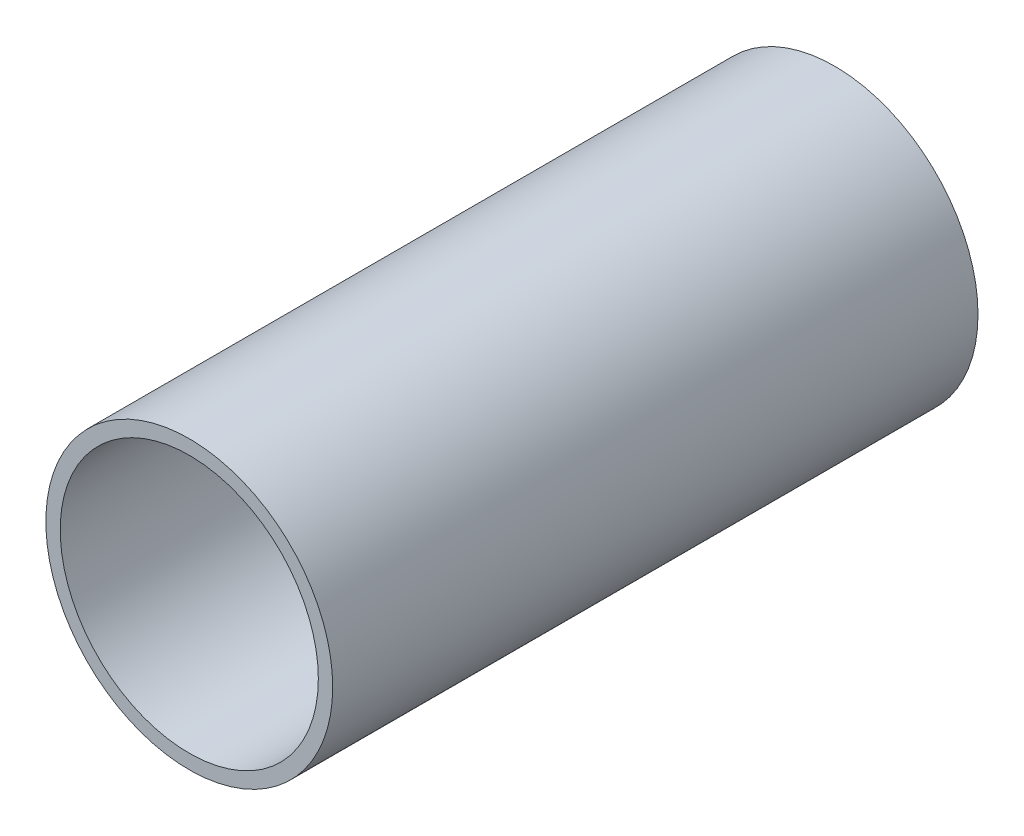
ISO-10303-21;
HEADER;
FILE_DESCRIPTION(('STEP AP214'),'2;1');
FILE_NAME('part.step','',(''),(''),'','','');
FILE_SCHEMA(('AUTOMOTIVE_DESIGN { 1 0 10303 214 1 1 1 1 }'));
ENDSEC;
DATA;
#1=APPLICATION_CONTEXT('core data for automotive mechanical design processes');
#2=APPLICATION_PROTOCOL_DEFINITION('international standard','automotive_design',2000,#1);
#3=PRODUCT_CONTEXT('',#1,'mechanical');
#4=PRODUCT('Part','Part','',(#3));
#5=PRODUCT_RELATED_PRODUCT_CATEGORY('part','',(#4));
#6=PRODUCT_DEFINITION_FORMATION('','',#4);
#7=PRODUCT_DEFINITION_CONTEXT('part definition',#1,'design');
#8=PRODUCT_DEFINITION('design','',#6,#7);
#9=PRODUCT_DEFINITION_SHAPE('','',#8);
#10=(LENGTH_UNIT() NAMED_UNIT(*) SI_UNIT(.MILLI.,.METRE.));
#11=(NAMED_UNIT(*) PLANE_ANGLE_UNIT() SI_UNIT($,.RADIAN.));
#12=(NAMED_UNIT(*) SI_UNIT($,.STERADIAN.) SOLID_ANGLE_UNIT());
#13=UNCERTAINTY_MEASURE_WITH_UNIT(LENGTH_MEASURE(1.E-05),#10,'distance_accuracy_value','');
#14=(GEOMETRIC_REPRESENTATION_CONTEXT(3) GLOBAL_UNCERTAINTY_ASSIGNED_CONTEXT((#13)) GLOBAL_UNIT_ASSIGNED_CONTEXT((#10,
#11,#12)) REPRESENTATION_CONTEXT('',''));
#15=CARTESIAN_POINT('',(0.,0.,0.));
#16=DIRECTION('',(0.,0.,1.));
#17=DIRECTION('',(1.,0.,0.));
#18=AXIS2_PLACEMENT_3D('',#15,#16,#17);
#19=CARTESIAN_POINT('',(0.,0.,100.));
#20=DIRECTION('',(0.,0.,1.));
#21=DIRECTION('',(1.,0.,0.));
#22=AXIS2_PLACEMENT_3D('',#19,#20,#21);
#23=PLANE('',#22);
#24=CARTESIAN_POINT('',(0.,0.,100.));
#25=DIRECTION('',(0.,0.,1.));
#26=DIRECTION('',(1.,0.,0.));
#27=AXIS2_PLACEMENT_3D('',#24,#25,#26);
#28=CIRCLE('',#27,22.225);
#29=CARTESIAN_POINT('',(22.225,0.,100.));
#30=VERTEX_POINT('',#29);
#31=EDGE_CURVE('E10',#30,#30,#28,.T.);
#32=ORIENTED_EDGE('',*,*,#31,.T.);
#33=EDGE_LOOP('',(#32));
#34=FACE_BOUND('',#33,.T.);
#35=CARTESIAN_POINT('',(0.,0.,100.));
#36=DIRECTION('',(0.,0.,1.));
#37=DIRECTION('',(1.,0.,0.));
#38=AXIS2_PLACEMENT_3D('',#35,#36,#37);
#39=CIRCLE('',#38,20.);
#40=CARTESIAN_POINT('',(20.,0.,100.));
#41=VERTEX_POINT('',#40);
#42=EDGE_CURVE('E44',#41,#41,#39,.T.);
#43=ORIENTED_EDGE('',*,*,#42,.F.);
#44=EDGE_LOOP('',(#43));
#45=FACE_BOUND('',#44,.T.);
#46=ADVANCED_FACE('F33',(#34,#45),#23,.T.);
#47=CARTESIAN_POINT('',(0.,0.,0.));
#48=DIRECTION('',(0.,0.,1.));
#49=DIRECTION('',(1.,0.,0.));
#50=AXIS2_PLACEMENT_3D('',#47,#48,#49);
#51=PLANE('',#50);
#52=CARTESIAN_POINT('',(0.,0.,0.));
#53=DIRECTION('',(0.,0.,1.));
#54=DIRECTION('',(1.,0.,0.));
#55=AXIS2_PLACEMENT_3D('',#52,#53,#54);
#56=CIRCLE('',#55,22.225);
#57=CARTESIAN_POINT('',(22.225,0.,0.));
#58=VERTEX_POINT('',#57);
#59=EDGE_CURVE('E37',#58,#58,#56,.T.);
#60=ORIENTED_EDGE('',*,*,#59,.F.);
#61=EDGE_LOOP('',(#60));
#62=FACE_BOUND('',#61,.T.);
#63=CARTESIAN_POINT('',(0.,0.,0.));
#64=DIRECTION('',(0.,0.,1.));
#65=DIRECTION('',(1.,0.,0.));
#66=AXIS2_PLACEMENT_3D('',#63,#64,#65);
#67=CIRCLE('',#66,20.);
#68=CARTESIAN_POINT('',(20.,0.,0.));
#69=VERTEX_POINT('',#68);
#70=EDGE_CURVE('E46',#69,#69,#67,.T.);
#71=ORIENTED_EDGE('',*,*,#70,.T.);
#72=EDGE_LOOP('',(#71));
#73=FACE_BOUND('',#72,.T.);
#74=ADVANCED_FACE('F56',(#62,#73),#51,.F.);
#75=CARTESIAN_POINT('',(0.,0.,100.));
#76=DIRECTION('',(0.,0.,-1.));
#77=DIRECTION('',(-1.,0.,0.));
#78=AXIS2_PLACEMENT_3D('',#75,#76,#77);
#79=CYLINDRICAL_SURFACE('',#78,22.225);
#80=ORIENTED_EDGE('',*,*,#31,.F.);
#81=EDGE_LOOP('',(#80));
#82=FACE_BOUND('',#81,.T.);
#83=ORIENTED_EDGE('',*,*,#59,.T.);
#84=EDGE_LOOP('',(#83));
#85=FACE_BOUND('',#84,.T.);
#86=ADVANCED_FACE('F35',(#82,#85),#79,.T.);
#87=CARTESIAN_POINT('',(0.,0.,100.));
#88=DIRECTION('',(0.,0.,-1.));
#89=DIRECTION('',(-1.,0.,0.));
#90=AXIS2_PLACEMENT_3D('',#87,#88,#89);
#91=CYLINDRICAL_SURFACE('',#90,20.);
#92=ORIENTED_EDGE('',*,*,#42,.T.);
#93=EDGE_LOOP('',(#92));
#94=FACE_BOUND('',#93,.T.);
#95=ORIENTED_EDGE('',*,*,#70,.F.);
#96=EDGE_LOOP('',(#95));
#97=FACE_BOUND('',#96,.T.);
#98=ADVANCED_FACE('F52',(#94,#97),#91,.F.);
#99=CLOSED_SHELL('',(#46,#74,#86,#98));
#100=MANIFOLD_SOLID_BREP('B2',#99);
#101=ADVANCED_BREP_SHAPE_REPRESENTATION('',(#18,#100),#14);
#102=SHAPE_DEFINITION_REPRESENTATION(#9,#101);
ENDSEC;
END-ISO-10303-21;
